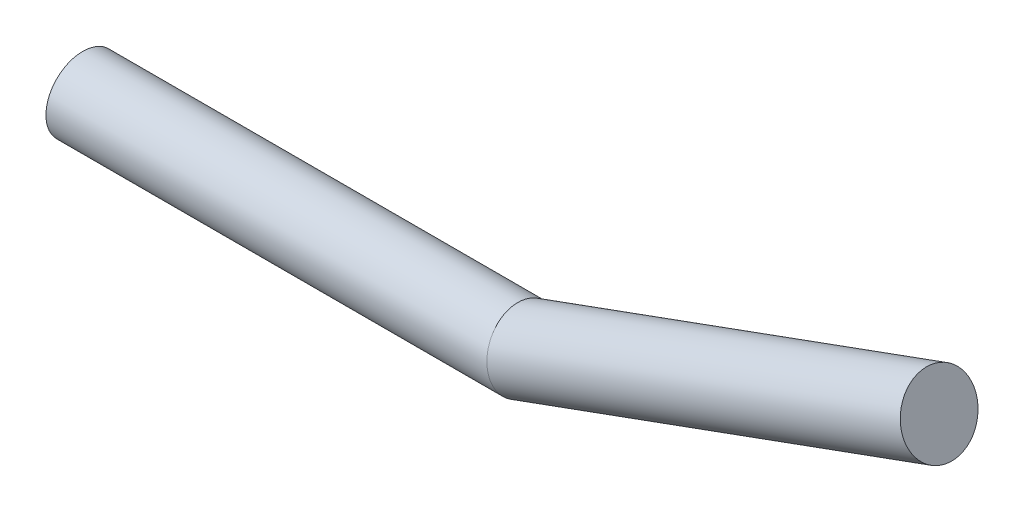
ISO-10303-21;
HEADER;
FILE_DESCRIPTION(('STEP AP214'),'2;1');
FILE_NAME('part.step','',(''),(''),'','','');
FILE_SCHEMA(('AUTOMOTIVE_DESIGN { 1 0 10303 214 1 1 1 1 }'));
ENDSEC;
DATA;
#1=APPLICATION_CONTEXT('core data for automotive mechanical design processes');
#2=APPLICATION_PROTOCOL_DEFINITION('international standard','automotive_design',2000,#1);
#3=PRODUCT_CONTEXT('',#1,'mechanical');
#4=PRODUCT('Part','Part','',(#3));
#5=PRODUCT_RELATED_PRODUCT_CATEGORY('part','',(#4));
#6=PRODUCT_DEFINITION_FORMATION('','',#4);
#7=PRODUCT_DEFINITION_CONTEXT('part definition',#1,'design');
#8=PRODUCT_DEFINITION('design','',#6,#7);
#9=PRODUCT_DEFINITION_SHAPE('','',#8);
#10=(LENGTH_UNIT() NAMED_UNIT(*) SI_UNIT(.MILLI.,.METRE.));
#11=(NAMED_UNIT(*) PLANE_ANGLE_UNIT() SI_UNIT($,.RADIAN.));
#12=(NAMED_UNIT(*) SI_UNIT($,.STERADIAN.) SOLID_ANGLE_UNIT());
#13=UNCERTAINTY_MEASURE_WITH_UNIT(LENGTH_MEASURE(1.E-05),#10,'distance_accuracy_value','');
#14=(GEOMETRIC_REPRESENTATION_CONTEXT(3) GLOBAL_UNCERTAINTY_ASSIGNED_CONTEXT((#13)) GLOBAL_UNIT_ASSIGNED_CONTEXT((#10,
#11,#12)) REPRESENTATION_CONTEXT('',''));
#15=CARTESIAN_POINT('',(0.,0.,0.));
#16=DIRECTION('',(0.,0.,1.));
#17=DIRECTION('',(1.,0.,0.));
#18=AXIS2_PLACEMENT_3D('',#15,#16,#17);
#19=CARTESIAN_POINT('',(11.6381557247154,2.05212085995402,0.));
#20=DIRECTION('',(0.939692620785908,0.34202014332567,0.));
#21=DIRECTION('',(0.,0.,-1.));
#22=AXIS2_PLACEMENT_3D('',#19,#20,#21);
#23=PLANE('',#22);
#24=CARTESIAN_POINT('',(11.6381557247154,2.05212085995402,0.));
#25=DIRECTION('',(0.939692620785908,0.34202014332567,0.));
#26=DIRECTION('',(0.,0.,-1.));
#27=AXIS2_PLACEMENT_3D('',#24,#25,#26);
#28=CIRCLE('',#27,0.5);
#29=CARTESIAN_POINT('',(11.6381557247154,2.05212085995402,-0.5));
#30=VERTEX_POINT('',#29);
#31=EDGE_CURVE('E39',#30,#30,#28,.T.);
#32=ORIENTED_EDGE('',*,*,#31,.T.);
#33=EDGE_LOOP('',(#32));
#34=FACE_BOUND('',#33,.T.);
#35=ADVANCED_FACE('F36',(#34),#23,.T.);
#36=CARTESIAN_POINT('',(0.,0.,0.));
#37=DIRECTION('',(1.,0.,0.));
#38=DIRECTION('',(0.,0.,-1.));
#39=AXIS2_PLACEMENT_3D('',#36,#37,#38);
#40=PLANE('',#39);
#41=CARTESIAN_POINT('',(0.,0.,0.));
#42=DIRECTION('',(1.,0.,0.));
#43=DIRECTION('',(0.,0.,-1.));
#44=AXIS2_PLACEMENT_3D('',#41,#42,#43);
#45=CIRCLE('',#44,0.5);
#46=CARTESIAN_POINT('',(0.,0.,-0.5));
#47=VERTEX_POINT('',#46);
#48=EDGE_CURVE('E43',#47,#47,#45,.T.);
#49=ORIENTED_EDGE('',*,*,#48,.F.);
#50=EDGE_LOOP('',(#49));
#51=FACE_BOUND('',#50,.T.);
#52=ADVANCED_FACE('F57',(#51),#40,.F.);
#53=CARTESIAN_POINT('',(5.72376825904248,-0.100540131468068,0.));
#54=DIRECTION('',(0.939692620785908,0.34202014332567,0.));
#55=DIRECTION('',(-0.34202014332567,0.939692620785908,0.));
#56=AXIS2_PLACEMENT_3D('',#53,#54,#55);
#57=CYLINDRICAL_SURFACE('',#56,0.5);
#58=CARTESIAN_POINT('',(6.,0.,0.));
#59=DIRECTION('',(0.984807753012208,0.173648177666931,0.));
#60=DIRECTION('',(0.173648177666931,-0.984807753012208,0.));
#61=AXIS2_PLACEMENT_3D('',#58,#59,#60);
#62=ELLIPSE('',#61,0.507713305942873,0.5);
#63=CARTESIAN_POINT('',(6.08816349035423,-0.5,0.));
#64=VERTEX_POINT('',#63);
#65=EDGE_CURVE('E10',#64,#64,#62,.F.);
#66=ORIENTED_EDGE('',*,*,#65,.F.);
#67=EDGE_LOOP('',(#66));
#68=FACE_BOUND('',#67,.T.);
#69=ORIENTED_EDGE('',*,*,#31,.F.);
#70=EDGE_LOOP('',(#69));
#71=FACE_BOUND('',#70,.T.);
#72=ADVANCED_FACE('F54',(#68,#71),#57,.T.);
#73=CARTESIAN_POINT('',(0.,0.,0.));
#74=DIRECTION('',(1.,0.,0.));
#75=DIRECTION('',(0.,0.,-1.));
#76=AXIS2_PLACEMENT_3D('',#73,#74,#75);
#77=CYLINDRICAL_SURFACE('',#76,0.5);
#78=ORIENTED_EDGE('',*,*,#48,.T.);
#79=EDGE_LOOP('',(#78));
#80=FACE_BOUND('',#79,.T.);
#81=ORIENTED_EDGE('',*,*,#65,.T.);
#82=EDGE_LOOP('',(#81));
#83=FACE_BOUND('',#82,.T.);
#84=ADVANCED_FACE('F56',(#80,#83),#77,.T.);
#85=CLOSED_SHELL('',(#35,#52,#72,#84));
#86=MANIFOLD_SOLID_BREP('B2',#85);
#87=ADVANCED_BREP_SHAPE_REPRESENTATION('',(#18,#86),#14);
#88=SHAPE_DEFINITION_REPRESENTATION(#9,#87);
ENDSEC;
END-ISO-10303-21;
